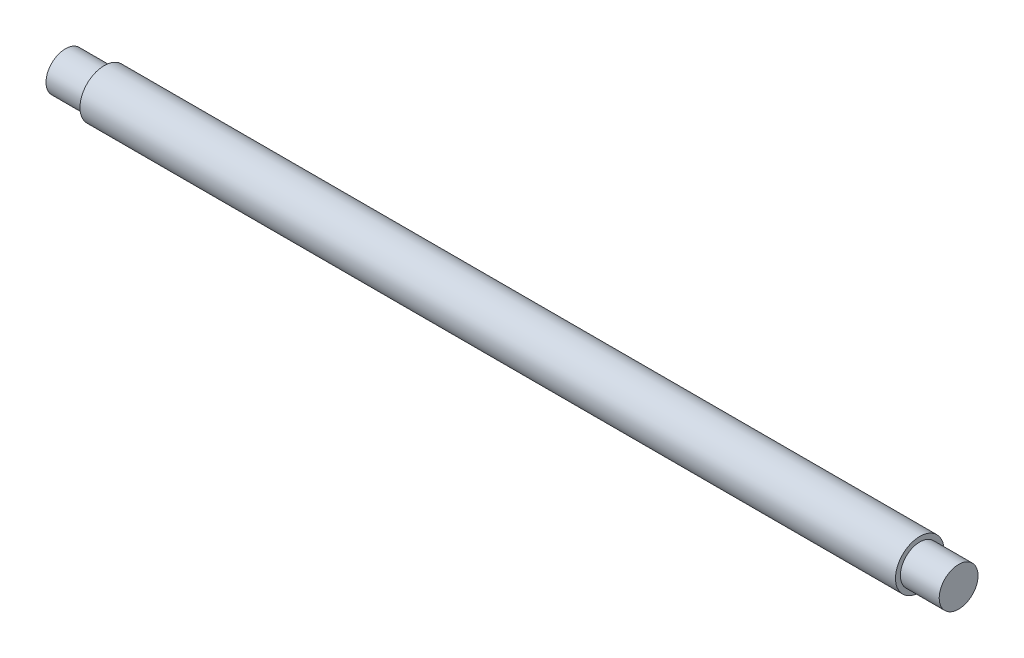
ISO-10303-21;
HEADER;
FILE_DESCRIPTION(('STEP AP214'),'2;1');
FILE_NAME('part.step','',(''),(''),'','','');
FILE_SCHEMA(('AUTOMOTIVE_DESIGN { 1 0 10303 214 1 1 1 1 }'));
ENDSEC;
DATA;
#1=APPLICATION_CONTEXT('core data for automotive mechanical design processes');
#2=APPLICATION_PROTOCOL_DEFINITION('international standard','automotive_design',2000,#1);
#3=PRODUCT_CONTEXT('',#1,'mechanical');
#4=PRODUCT('Part','Part','',(#3));
#5=PRODUCT_RELATED_PRODUCT_CATEGORY('part','',(#4));
#6=PRODUCT_DEFINITION_FORMATION('','',#4);
#7=PRODUCT_DEFINITION_CONTEXT('part definition',#1,'design');
#8=PRODUCT_DEFINITION('design','',#6,#7);
#9=PRODUCT_DEFINITION_SHAPE('','',#8);
#10=(LENGTH_UNIT() NAMED_UNIT(*) SI_UNIT(.MILLI.,.METRE.));
#11=(NAMED_UNIT(*) PLANE_ANGLE_UNIT() SI_UNIT($,.RADIAN.));
#12=(NAMED_UNIT(*) SI_UNIT($,.STERADIAN.) SOLID_ANGLE_UNIT());
#13=UNCERTAINTY_MEASURE_WITH_UNIT(LENGTH_MEASURE(1.E-05),#10,'distance_accuracy_value','');
#14=(GEOMETRIC_REPRESENTATION_CONTEXT(3) GLOBAL_UNCERTAINTY_ASSIGNED_CONTEXT((#13)) GLOBAL_UNIT_ASSIGNED_CONTEXT((#10,
#11,#12)) REPRESENTATION_CONTEXT('',''));
#15=CARTESIAN_POINT('',(0.,0.,0.));
#16=DIRECTION('',(0.,0.,1.));
#17=DIRECTION('',(1.,0.,0.));
#18=AXIS2_PLACEMENT_3D('',#15,#16,#17);
#19=CARTESIAN_POINT('',(230.,0.,0.));
#20=DIRECTION('',(-1.,0.,0.));
#21=DIRECTION('',(0.,0.,1.));
#22=AXIS2_PLACEMENT_3D('',#19,#20,#21);
#23=CYLINDRICAL_SURFACE('',#22,12.5);
#24=CARTESIAN_POINT('',(-210.,0.,0.));
#25=DIRECTION('',(-1.,0.,0.));
#26=DIRECTION('',(0.,0.,1.));
#27=AXIS2_PLACEMENT_3D('',#24,#25,#26);
#28=CIRCLE('',#27,12.5);
#29=CARTESIAN_POINT('',(-210.,0.,12.5));
#30=VERTEX_POINT('',#29);
#31=EDGE_CURVE('E10',#30,#30,#28,.T.);
#32=ORIENTED_EDGE('',*,*,#31,.F.);
#33=EDGE_LOOP('',(#32));
#34=FACE_BOUND('',#33,.T.);
#35=CARTESIAN_POINT('',(210.,0.,0.));
#36=DIRECTION('',(-1.,0.,0.));
#37=DIRECTION('',(0.,0.,1.));
#38=AXIS2_PLACEMENT_3D('',#35,#36,#37);
#39=CIRCLE('',#38,12.5);
#40=CARTESIAN_POINT('',(210.,0.,12.5));
#41=VERTEX_POINT('',#40);
#42=EDGE_CURVE('E54',#41,#41,#39,.T.);
#43=ORIENTED_EDGE('',*,*,#42,.T.);
#44=EDGE_LOOP('',(#43));
#45=FACE_BOUND('',#44,.T.);
#46=ADVANCED_FACE('F39',(#34,#45),#23,.T.);
#47=CARTESIAN_POINT('',(-210.,0.,0.));
#48=DIRECTION('',(-1.,0.,0.));
#49=DIRECTION('',(0.,0.,1.));
#50=AXIS2_PLACEMENT_3D('',#47,#48,#49);
#51=PLANE('',#50);
#52=CARTESIAN_POINT('',(-210.,0.,0.));
#53=DIRECTION('',(-1.,0.,0.));
#54=DIRECTION('',(0.,0.,1.));
#55=AXIS2_PLACEMENT_3D('',#52,#53,#54);
#56=CIRCLE('',#55,10.);
#57=CARTESIAN_POINT('',(-210.,0.,10.));
#58=VERTEX_POINT('',#57);
#59=EDGE_CURVE('E45',#58,#58,#56,.T.);
#60=ORIENTED_EDGE('',*,*,#59,.F.);
#61=EDGE_LOOP('',(#60));
#62=FACE_BOUND('',#61,.T.);
#63=ORIENTED_EDGE('',*,*,#31,.T.);
#64=EDGE_LOOP('',(#63));
#65=FACE_BOUND('',#64,.T.);
#66=ADVANCED_FACE('F80',(#62,#65),#51,.T.);
#67=CARTESIAN_POINT('',(-210.,0.,0.));
#68=DIRECTION('',(-1.,0.,0.));
#69=DIRECTION('',(0.,0.,1.));
#70=AXIS2_PLACEMENT_3D('',#67,#68,#69);
#71=CYLINDRICAL_SURFACE('',#70,10.);
#72=ORIENTED_EDGE('',*,*,#59,.T.);
#73=EDGE_LOOP('',(#72));
#74=FACE_BOUND('',#73,.T.);
#75=CARTESIAN_POINT('',(-230.,0.,0.));
#76=DIRECTION('',(-1.,0.,0.));
#77=DIRECTION('',(0.,0.,1.));
#78=AXIS2_PLACEMENT_3D('',#75,#76,#77);
#79=CIRCLE('',#78,10.);
#80=CARTESIAN_POINT('',(-230.,0.,10.));
#81=VERTEX_POINT('',#80);
#82=EDGE_CURVE('E49',#81,#81,#79,.T.);
#83=ORIENTED_EDGE('',*,*,#82,.F.);
#84=EDGE_LOOP('',(#83));
#85=FACE_BOUND('',#84,.T.);
#86=ADVANCED_FACE('F85',(#74,#85),#71,.T.);
#87=CARTESIAN_POINT('',(-230.,0.,0.));
#88=DIRECTION('',(1.,0.,0.));
#89=DIRECTION('',(0.,0.,-1.));
#90=AXIS2_PLACEMENT_3D('',#87,#88,#89);
#91=PLANE('',#90);
#92=ORIENTED_EDGE('',*,*,#82,.T.);
#93=EDGE_LOOP('',(#92));
#94=FACE_BOUND('',#93,.T.);
#95=ADVANCED_FACE('F91',(#94),#91,.F.);
#96=CARTESIAN_POINT('',(210.,0.,0.));
#97=DIRECTION('',(1.,0.,0.));
#98=DIRECTION('',(0.,0.,1.));
#99=AXIS2_PLACEMENT_3D('',#96,#97,#98);
#100=PLANE('',#99);
#101=ORIENTED_EDGE('',*,*,#42,.F.);
#102=EDGE_LOOP('',(#101));
#103=FACE_BOUND('',#102,.T.);
#104=CARTESIAN_POINT('',(210.,0.,0.));
#105=DIRECTION('',(-1.,0.,0.));
#106=DIRECTION('',(0.,0.,1.));
#107=AXIS2_PLACEMENT_3D('',#104,#105,#106);
#108=CIRCLE('',#107,10.);
#109=CARTESIAN_POINT('',(210.,0.,10.));
#110=VERTEX_POINT('',#109);
#111=EDGE_CURVE('E58',#110,#110,#108,.T.);
#112=ORIENTED_EDGE('',*,*,#111,.T.);
#113=EDGE_LOOP('',(#112));
#114=FACE_BOUND('',#113,.T.);
#115=ADVANCED_FACE('F65',(#103,#114),#100,.T.);
#116=CARTESIAN_POINT('',(210.,0.,0.));
#117=DIRECTION('',(1.,0.,0.));
#118=DIRECTION('',(0.,0.,-1.));
#119=AXIS2_PLACEMENT_3D('',#116,#117,#118);
#120=CYLINDRICAL_SURFACE('',#119,10.);
#121=ORIENTED_EDGE('',*,*,#111,.F.);
#122=EDGE_LOOP('',(#121));
#123=FACE_BOUND('',#122,.T.);
#124=CARTESIAN_POINT('',(230.,0.,0.));
#125=DIRECTION('',(-1.,0.,0.));
#126=DIRECTION('',(0.,0.,1.));
#127=AXIS2_PLACEMENT_3D('',#124,#125,#126);
#128=CIRCLE('',#127,10.);
#129=CARTESIAN_POINT('',(230.,0.,10.));
#130=VERTEX_POINT('',#129);
#131=EDGE_CURVE('E59',#130,#130,#128,.T.);
#132=ORIENTED_EDGE('',*,*,#131,.T.);
#133=EDGE_LOOP('',(#132));
#134=FACE_BOUND('',#133,.T.);
#135=ADVANCED_FACE('F67',(#123,#134),#120,.T.);
#136=CARTESIAN_POINT('',(230.,0.,0.));
#137=DIRECTION('',(1.,0.,0.));
#138=DIRECTION('',(0.,0.,-1.));
#139=AXIS2_PLACEMENT_3D('',#136,#137,#138);
#140=PLANE('',#139);
#141=ORIENTED_EDGE('',*,*,#131,.F.);
#142=EDGE_LOOP('',(#141));
#143=FACE_BOUND('',#142,.T.);
#144=ADVANCED_FACE('F70',(#143),#140,.T.);
#145=CLOSED_SHELL('',(#46,#66,#86,#95,#115,#135,#144));
#146=MANIFOLD_SOLID_BREP('B2',#145);
#147=ADVANCED_BREP_SHAPE_REPRESENTATION('',(#18,#146),#14);
#148=SHAPE_DEFINITION_REPRESENTATION(#9,#147);
ENDSEC;
END-ISO-10303-21;
